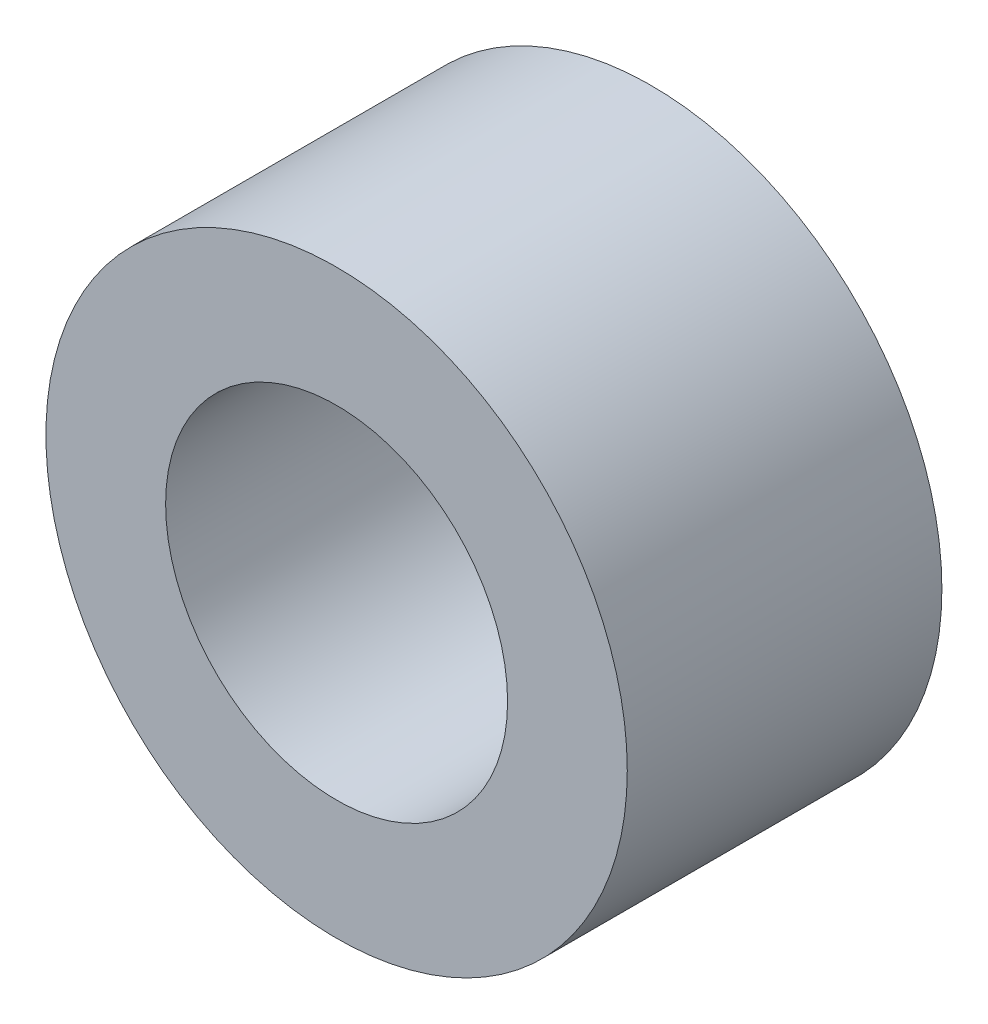
ISO-10303-21;
HEADER;
FILE_DESCRIPTION(('STEP AP214'),'2;1');
FILE_NAME('part.step','',(''),(''),'','','');
FILE_SCHEMA(('AUTOMOTIVE_DESIGN { 1 0 10303 214 1 1 1 1 }'));
ENDSEC;
DATA;
#1=APPLICATION_CONTEXT('core data for automotive mechanical design processes');
#2=APPLICATION_PROTOCOL_DEFINITION('international standard','automotive_design',2000,#1);
#3=PRODUCT_CONTEXT('',#1,'mechanical');
#4=PRODUCT('Part','Part','',(#3));
#5=PRODUCT_RELATED_PRODUCT_CATEGORY('part','',(#4));
#6=PRODUCT_DEFINITION_FORMATION('','',#4);
#7=PRODUCT_DEFINITION_CONTEXT('part definition',#1,'design');
#8=PRODUCT_DEFINITION('design','',#6,#7);
#9=PRODUCT_DEFINITION_SHAPE('','',#8);
#10=(LENGTH_UNIT() NAMED_UNIT(*) SI_UNIT(.MILLI.,.METRE.));
#11=(NAMED_UNIT(*) PLANE_ANGLE_UNIT() SI_UNIT($,.RADIAN.));
#12=(NAMED_UNIT(*) SI_UNIT($,.STERADIAN.) SOLID_ANGLE_UNIT());
#13=UNCERTAINTY_MEASURE_WITH_UNIT(LENGTH_MEASURE(1.E-05),#10,'distance_accuracy_value','');
#14=(GEOMETRIC_REPRESENTATION_CONTEXT(3) GLOBAL_UNCERTAINTY_ASSIGNED_CONTEXT((#13)) GLOBAL_UNIT_ASSIGNED_CONTEXT((#10,
#11,#12)) REPRESENTATION_CONTEXT('',''));
#15=CARTESIAN_POINT('',(0.,0.,0.));
#16=DIRECTION('',(0.,0.,1.));
#17=DIRECTION('',(1.,0.,0.));
#18=AXIS2_PLACEMENT_3D('',#15,#16,#17);
#19=CARTESIAN_POINT('',(0.,0.,4.6));
#20=DIRECTION('',(0.,0.,-1.));
#21=DIRECTION('',(-1.,0.,0.));
#22=AXIS2_PLACEMENT_3D('',#19,#20,#21);
#23=CYLINDRICAL_SURFACE('',#22,8.5);
#24=CARTESIAN_POINT('',(0.,0.,4.6));
#25=DIRECTION('',(0.,0.,1.));
#26=DIRECTION('',(1.,0.,0.));
#27=AXIS2_PLACEMENT_3D('',#24,#25,#26);
#28=CIRCLE('',#27,8.5);
#29=CARTESIAN_POINT('',(8.5,0.,4.6));
#30=VERTEX_POINT('',#29);
#31=EDGE_CURVE('E10',#30,#30,#28,.T.);
#32=ORIENTED_EDGE('',*,*,#31,.F.);
#33=EDGE_LOOP('',(#32));
#34=FACE_BOUND('',#33,.T.);
#35=CARTESIAN_POINT('',(0.,0.,-4.6));
#36=DIRECTION('',(0.,0.,1.));
#37=DIRECTION('',(1.,0.,0.));
#38=AXIS2_PLACEMENT_3D('',#35,#36,#37);
#39=CIRCLE('',#38,8.5);
#40=CARTESIAN_POINT('',(8.5,0.,-4.6));
#41=VERTEX_POINT('',#40);
#42=EDGE_CURVE('E36',#41,#41,#39,.T.);
#43=ORIENTED_EDGE('',*,*,#42,.T.);
#44=EDGE_LOOP('',(#43));
#45=FACE_BOUND('',#44,.T.);
#46=ADVANCED_FACE('F33',(#34,#45),#23,.T.);
#47=CARTESIAN_POINT('',(0.,0.,4.6));
#48=DIRECTION('',(0.,0.,1.));
#49=DIRECTION('',(1.,0.,0.));
#50=AXIS2_PLACEMENT_3D('',#47,#48,#49);
#51=PLANE('',#50);
#52=CARTESIAN_POINT('',(0.,0.,4.6));
#53=DIRECTION('',(0.,0.,1.));
#54=DIRECTION('',(1.,0.,0.));
#55=AXIS2_PLACEMENT_3D('',#52,#53,#54);
#56=CIRCLE('',#55,5.);
#57=CARTESIAN_POINT('',(5.,0.,4.6));
#58=VERTEX_POINT('',#57);
#59=EDGE_CURVE('E45',#58,#58,#56,.T.);
#60=ORIENTED_EDGE('',*,*,#59,.F.);
#61=EDGE_LOOP('',(#60));
#62=FACE_BOUND('',#61,.T.);
#63=ORIENTED_EDGE('',*,*,#31,.T.);
#64=EDGE_LOOP('',(#63));
#65=FACE_BOUND('',#64,.T.);
#66=ADVANCED_FACE('F60',(#62,#65),#51,.T.);
#67=CARTESIAN_POINT('',(0.,0.,-4.6));
#68=DIRECTION('',(0.,0.,1.));
#69=DIRECTION('',(1.,0.,0.));
#70=AXIS2_PLACEMENT_3D('',#67,#68,#69);
#71=PLANE('',#70);
#72=CARTESIAN_POINT('',(0.,0.,-4.6));
#73=DIRECTION('',(0.,0.,1.));
#74=DIRECTION('',(1.,0.,0.));
#75=AXIS2_PLACEMENT_3D('',#72,#73,#74);
#76=CIRCLE('',#75,5.);
#77=CARTESIAN_POINT('',(5.,0.,-4.6));
#78=VERTEX_POINT('',#77);
#79=EDGE_CURVE('E43',#78,#78,#76,.T.);
#80=ORIENTED_EDGE('',*,*,#79,.T.);
#81=EDGE_LOOP('',(#80));
#82=FACE_BOUND('',#81,.T.);
#83=ORIENTED_EDGE('',*,*,#42,.F.);
#84=EDGE_LOOP('',(#83));
#85=FACE_BOUND('',#84,.T.);
#86=ADVANCED_FACE('F51',(#82,#85),#71,.F.);
#87=CARTESIAN_POINT('',(0.,0.,-4.6));
#88=DIRECTION('',(0.,0.,1.));
#89=DIRECTION('',(1.,0.,0.));
#90=AXIS2_PLACEMENT_3D('',#87,#88,#89);
#91=CYLINDRICAL_SURFACE('',#90,5.);
#92=ORIENTED_EDGE('',*,*,#79,.F.);
#93=EDGE_LOOP('',(#92));
#94=FACE_BOUND('',#93,.T.);
#95=ORIENTED_EDGE('',*,*,#59,.T.);
#96=EDGE_LOOP('',(#95));
#97=FACE_BOUND('',#96,.T.);
#98=ADVANCED_FACE('F54',(#94,#97),#91,.F.);
#99=CLOSED_SHELL('',(#46,#66,#86,#98));
#100=MANIFOLD_SOLID_BREP('B2',#99);
#101=ADVANCED_BREP_SHAPE_REPRESENTATION('',(#18,#100),#14);
#102=SHAPE_DEFINITION_REPRESENTATION(#9,#101);
ENDSEC;
END-ISO-10303-21;
